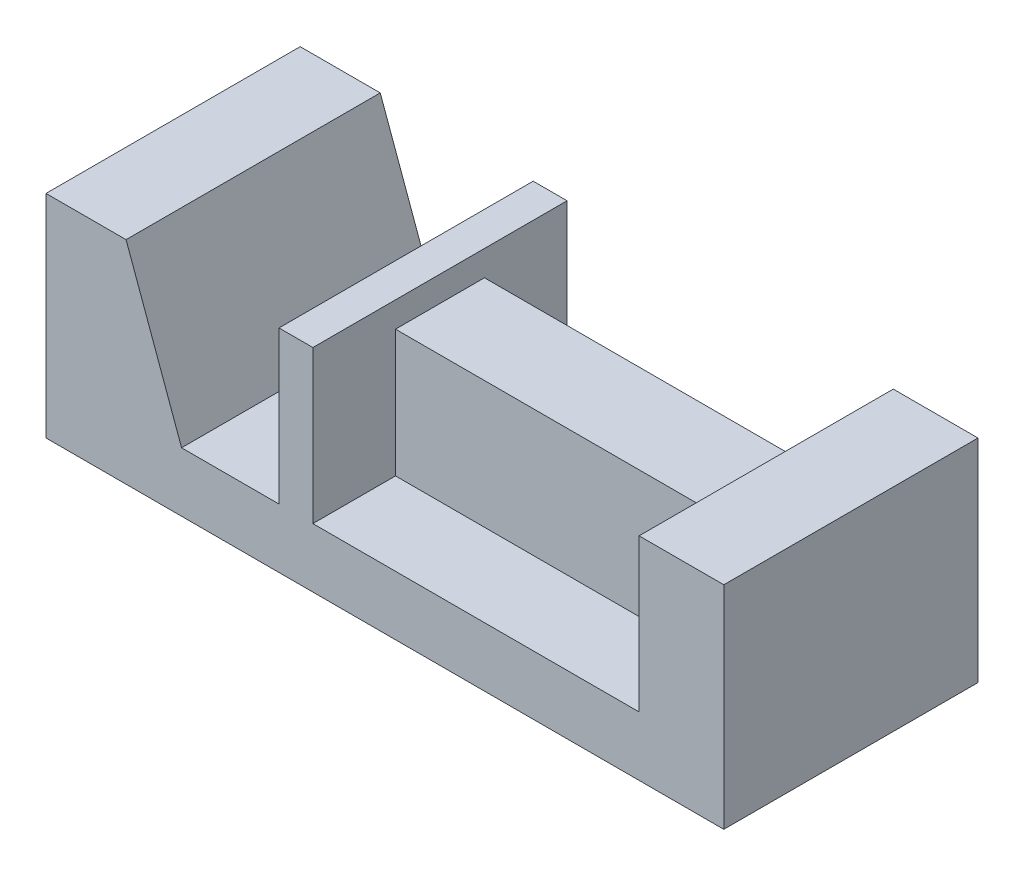
ISO-10303-21;
HEADER;
FILE_DESCRIPTION(('STEP AP214'),'2;1');
FILE_NAME('part.step','',(''),(''),'','','');
FILE_SCHEMA(('AUTOMOTIVE_DESIGN { 1 0 10303 214 1 1 1 1 }'));
ENDSEC;
DATA;
#1=APPLICATION_CONTEXT('core data for automotive mechanical design processes');
#2=APPLICATION_PROTOCOL_DEFINITION('international standard','automotive_design',2000,#1);
#3=PRODUCT_CONTEXT('',#1,'mechanical');
#4=PRODUCT('Part','Part','',(#3));
#5=PRODUCT_RELATED_PRODUCT_CATEGORY('part','',(#4));
#6=PRODUCT_DEFINITION_FORMATION('','',#4);
#7=PRODUCT_DEFINITION_CONTEXT('part definition',#1,'design');
#8=PRODUCT_DEFINITION('design','',#6,#7);
#9=PRODUCT_DEFINITION_SHAPE('','',#8);
#10=(LENGTH_UNIT() NAMED_UNIT(*) SI_UNIT(.MILLI.,.METRE.));
#11=(NAMED_UNIT(*) PLANE_ANGLE_UNIT() SI_UNIT($,.RADIAN.));
#12=(NAMED_UNIT(*) SI_UNIT($,.STERADIAN.) SOLID_ANGLE_UNIT());
#13=UNCERTAINTY_MEASURE_WITH_UNIT(LENGTH_MEASURE(1.E-05),#10,'distance_accuracy_value','');
#14=(GEOMETRIC_REPRESENTATION_CONTEXT(3) GLOBAL_UNCERTAINTY_ASSIGNED_CONTEXT((#13)) GLOBAL_UNIT_ASSIGNED_CONTEXT((#10,
#11,#12)) REPRESENTATION_CONTEXT('',''));
#15=CARTESIAN_POINT('',(0.,0.,0.));
#16=DIRECTION('',(0.,0.,1.));
#17=DIRECTION('',(1.,0.,0.));
#18=AXIS2_PLACEMENT_3D('',#15,#16,#17);
#19=CARTESIAN_POINT('',(81.7250000000001,14.,0.));
#20=DIRECTION('',(1.,0.,0.));
#21=DIRECTION('',(0.,0.,-1.));
#22=AXIS2_PLACEMENT_3D('',#19,#20,#21);
#23=PLANE('',#22);
#24=DIRECTION('',(0.,-1.,0.));
#25=VECTOR('',#24,1.);
#26=CARTESIAN_POINT('',(81.7250000000001,44.,19.5));
#27=LINE('',#26,#25);
#28=CARTESIAN_POINT('',(81.7250000000001,44.,19.5));
#29=VERTEX_POINT('',#28);
#30=CARTESIAN_POINT('',(81.7250000000001,14.,19.5));
#31=VERTEX_POINT('',#30);
#32=EDGE_CURVE('E156',#29,#31,#27,.T.);
#33=ORIENTED_EDGE('',*,*,#32,.F.);
#34=DIRECTION('',(0.,0.,-1.));
#35=VECTOR('',#34,1.);
#36=CARTESIAN_POINT('',(81.7250000000001,44.,19.5));
#37=LINE('',#36,#35);
#38=CARTESIAN_POINT('',(81.7250000000001,44.,40.5));
#39=VERTEX_POINT('',#38);
#40=EDGE_CURVE('E162',#39,#29,#37,.T.);
#41=ORIENTED_EDGE('',*,*,#40,.F.);
#42=DIRECTION('',(0.,-1.,0.));
#43=VECTOR('',#42,1.);
#44=CARTESIAN_POINT('',(81.7250000000001,44.,40.5));
#45=LINE('',#44,#43);
#46=CARTESIAN_POINT('',(81.7250000000001,14.,40.5));
#47=VERTEX_POINT('',#46);
#48=EDGE_CURVE('E474',#39,#47,#45,.T.);
#49=ORIENTED_EDGE('',*,*,#48,.T.);
#50=DIRECTION('',(0.,0.,1.));
#51=VECTOR('',#50,1.);
#52=CARTESIAN_POINT('',(81.7250000000001,14.,0.));
#53=LINE('',#52,#51);
#54=CARTESIAN_POINT('',(81.7250000000001,14.,60.));
#55=VERTEX_POINT('',#54);
#56=EDGE_CURVE('E214',#47,#55,#53,.T.);
#57=ORIENTED_EDGE('',*,*,#56,.T.);
#58=DIRECTION('',(0.,1.,0.));
#59=VECTOR('',#58,1.);
#60=CARTESIAN_POINT('',(81.7250000000001,14.,60.));
#61=LINE('',#60,#59);
#62=CARTESIAN_POINT('',(81.7250000000001,50.,60.));
#63=VERTEX_POINT('',#62);
#64=EDGE_CURVE('E194',#55,#63,#61,.T.);
#65=ORIENTED_EDGE('',*,*,#64,.T.);
#66=DIRECTION('',(0.,0.,1.));
#67=VECTOR('',#66,1.);
#68=CARTESIAN_POINT('',(81.7250000000001,50.,0.));
#69=LINE('',#68,#67);
#70=CARTESIAN_POINT('',(81.7250000000001,50.,0.));
#71=VERTEX_POINT('',#70);
#72=EDGE_CURVE('E207',#71,#63,#69,.T.);
#73=ORIENTED_EDGE('',*,*,#72,.F.);
#74=DIRECTION('',(0.,1.,0.));
#75=VECTOR('',#74,1.);
#76=CARTESIAN_POINT('',(81.7250000000001,14.,0.));
#77=LINE('',#76,#75);
#78=CARTESIAN_POINT('',(81.7250000000001,14.,0.));
#79=VERTEX_POINT('',#78);
#80=EDGE_CURVE('E197',#79,#71,#77,.T.);
#81=ORIENTED_EDGE('',*,*,#80,.F.);
#82=EDGE_CURVE('E176',#79,#31,#53,.T.);
#83=ORIENTED_EDGE('',*,*,#82,.T.);
#84=EDGE_LOOP('',(#33,#41,#49,#57,#65,#73,#81,#83));
#85=FACE_BOUND('',#84,.T.);
#86=ADVANCED_FACE('F40',(#85),#23,.F.);
#87=CARTESIAN_POINT('',(4.72500000000005,14.,0.));
#88=DIRECTION('',(0.,-1.,0.));
#89=DIRECTION('',(1.,0.,0.));
#90=AXIS2_PLACEMENT_3D('',#87,#88,#89);
#91=PLANE('',#90);
#92=DIRECTION('',(-1.,0.,0.));
#93=VECTOR('',#92,1.);
#94=CARTESIAN_POINT('',(4.72500000000005,14.,19.5));
#95=LINE('',#94,#93);
#96=CARTESIAN_POINT('',(4.72500000000005,14.,19.5));
#97=VERTEX_POINT('',#96);
#98=EDGE_CURVE('E479',#31,#97,#95,.T.);
#99=ORIENTED_EDGE('',*,*,#98,.F.);
#100=ORIENTED_EDGE('',*,*,#82,.F.);
#101=DIRECTION('',(1.,0.,0.));
#102=VECTOR('',#101,1.);
#103=CARTESIAN_POINT('',(4.72500000000005,14.,0.));
#104=LINE('',#103,#102);
#105=CARTESIAN_POINT('',(4.72500000000005,14.,0.));
#106=VERTEX_POINT('',#105);
#107=EDGE_CURVE('E64',#106,#79,#104,.T.);
#108=ORIENTED_EDGE('',*,*,#107,.F.);
#109=DIRECTION('',(0.,0.,1.));
#110=VECTOR('',#109,1.);
#111=CARTESIAN_POINT('',(4.72500000000005,14.,0.));
#112=LINE('',#111,#110);
#113=EDGE_CURVE('E215',#106,#97,#112,.T.);
#114=ORIENTED_EDGE('',*,*,#113,.T.);
#115=EDGE_LOOP('',(#99,#100,#108,#114));
#116=FACE_BOUND('',#115,.T.);
#117=ADVANCED_FACE('F367',(#116),#91,.F.);
#118=DIRECTION('',(1.,0.,0.));
#119=VECTOR('',#118,1.);
#120=CARTESIAN_POINT('',(4.72500000000005,14.,40.5));
#121=LINE('',#120,#119);
#122=CARTESIAN_POINT('',(4.72500000000005,14.,40.5));
#123=VERTEX_POINT('',#122);
#124=EDGE_CURVE('E172',#123,#47,#121,.T.);
#125=ORIENTED_EDGE('',*,*,#124,.F.);
#126=CARTESIAN_POINT('',(4.72500000000005,14.,60.));
#127=VERTEX_POINT('',#126);
#128=EDGE_CURVE('E218',#123,#127,#112,.T.);
#129=ORIENTED_EDGE('',*,*,#128,.T.);
#130=DIRECTION('',(1.,0.,0.));
#131=VECTOR('',#130,1.);
#132=CARTESIAN_POINT('',(4.72500000000005,14.,60.));
#133=LINE('',#132,#131);
#134=EDGE_CURVE('E184',#127,#55,#133,.T.);
#135=ORIENTED_EDGE('',*,*,#134,.T.);
#136=ORIENTED_EDGE('',*,*,#56,.F.);
#137=EDGE_LOOP('',(#125,#129,#135,#136));
#138=FACE_BOUND('',#137,.T.);
#139=ADVANCED_FACE('F373',(#138),#91,.F.);
#140=CARTESIAN_POINT('',(4.72500000000004,50.,0.));
#141=DIRECTION('',(-1.,0.,0.));
#142=DIRECTION('',(0.,-1.,0.));
#143=AXIS2_PLACEMENT_3D('',#140,#141,#142);
#144=PLANE('',#143);
#145=DIRECTION('',(0.,-1.,0.));
#146=VECTOR('',#145,1.);
#147=CARTESIAN_POINT('',(4.72500000000005,44.,19.5));
#148=LINE('',#147,#146);
#149=CARTESIAN_POINT('',(4.72500000000004,44.,19.5));
#150=VERTEX_POINT('',#149);
#151=EDGE_CURVE('E56',#150,#97,#148,.T.);
#152=ORIENTED_EDGE('',*,*,#151,.T.);
#153=ORIENTED_EDGE('',*,*,#113,.F.);
#154=DIRECTION('',(0.,-1.,0.));
#155=VECTOR('',#154,1.);
#156=CARTESIAN_POINT('',(4.72500000000004,50.,0.));
#157=LINE('',#156,#155);
#158=CARTESIAN_POINT('',(4.72500000000004,50.,0.));
#159=VERTEX_POINT('',#158);
#160=EDGE_CURVE('E190',#159,#106,#157,.T.);
#161=ORIENTED_EDGE('',*,*,#160,.F.);
#162=DIRECTION('',(0.,0.,1.));
#163=VECTOR('',#162,1.);
#164=CARTESIAN_POINT('',(4.72500000000004,50.,0.));
#165=LINE('',#164,#163);
#166=CARTESIAN_POINT('',(4.72500000000004,50.,60.));
#167=VERTEX_POINT('',#166);
#168=EDGE_CURVE('E200',#159,#167,#165,.T.);
#169=ORIENTED_EDGE('',*,*,#168,.T.);
#170=DIRECTION('',(0.,-1.,0.));
#171=VECTOR('',#170,1.);
#172=CARTESIAN_POINT('',(4.72500000000004,50.,60.));
#173=LINE('',#172,#171);
#174=EDGE_CURVE('E178',#167,#127,#173,.T.);
#175=ORIENTED_EDGE('',*,*,#174,.T.);
#176=ORIENTED_EDGE('',*,*,#128,.F.);
#177=DIRECTION('',(0.,-1.,0.));
#178=VECTOR('',#177,1.);
#179=CARTESIAN_POINT('',(4.72500000000005,44.,40.5));
#180=LINE('',#179,#178);
#181=CARTESIAN_POINT('',(4.72500000000005,44.,40.5));
#182=VERTEX_POINT('',#181);
#183=EDGE_CURVE('E186',#182,#123,#180,.T.);
#184=ORIENTED_EDGE('',*,*,#183,.F.);
#185=DIRECTION('',(0.,0.,1.));
#186=VECTOR('',#185,1.);
#187=CARTESIAN_POINT('',(4.72500000000005,44.,19.5));
#188=LINE('',#187,#186);
#189=EDGE_CURVE('E161',#150,#182,#188,.T.);
#190=ORIENTED_EDGE('',*,*,#189,.F.);
#191=EDGE_LOOP('',(#152,#153,#161,#169,#175,#176,#184,#190));
#192=FACE_BOUND('',#191,.T.);
#193=ADVANCED_FACE('F364',(#192),#144,.F.);
#194=CARTESIAN_POINT('',(-58.275,50.,60.));
#195=DIRECTION('',(0.,-1.,0.));
#196=DIRECTION('',(0.,0.,-1.));
#197=AXIS2_PLACEMENT_3D('',#194,#195,#196);
#198=PLANE('',#197);
#199=DIRECTION('',(-1.,0.,0.));
#200=VECTOR('',#199,1.);
#201=CARTESIAN_POINT('',(-58.275,50.,0.));
#202=LINE('',#201,#200);
#203=CARTESIAN_POINT('',(101.725,50.,0.));
#204=VERTEX_POINT('',#203);
#205=EDGE_CURVE('E263',#204,#71,#202,.T.);
#206=ORIENTED_EDGE('',*,*,#205,.T.);
#207=ORIENTED_EDGE('',*,*,#72,.T.);
#208=DIRECTION('',(-1.,0.,0.));
#209=VECTOR('',#208,1.);
#210=CARTESIAN_POINT('',(-58.275,50.,60.));
#211=LINE('',#210,#209);
#212=CARTESIAN_POINT('',(101.725,50.,60.));
#213=VERTEX_POINT('',#212);
#214=EDGE_CURVE('E270',#213,#63,#211,.T.);
#215=ORIENTED_EDGE('',*,*,#214,.F.);
#216=DIRECTION('',(0.,0.,-1.));
#217=VECTOR('',#216,1.);
#218=CARTESIAN_POINT('',(101.725,50.,60.));
#219=LINE('',#218,#217);
#220=EDGE_CURVE('E293',#213,#204,#219,.T.);
#221=ORIENTED_EDGE('',*,*,#220,.T.);
#222=EDGE_LOOP('',(#206,#207,#215,#221));
#223=FACE_BOUND('',#222,.T.);
#224=ADVANCED_FACE('F311',(#223),#198,.F.);
#225=CARTESIAN_POINT('',(-3.27499999999996,50.,60.));
#226=VERTEX_POINT('',#225);
#227=EDGE_CURVE('E275',#167,#226,#211,.T.);
#228=ORIENTED_EDGE('',*,*,#227,.F.);
#229=ORIENTED_EDGE('',*,*,#168,.F.);
#230=CARTESIAN_POINT('',(-3.27499999999996,50.,0.));
#231=VERTEX_POINT('',#230);
#232=EDGE_CURVE('E289',#159,#231,#202,.T.);
#233=ORIENTED_EDGE('',*,*,#232,.T.);
#234=DIRECTION('',(0.,0.,1.));
#235=VECTOR('',#234,1.);
#236=CARTESIAN_POINT('',(-3.27499999999996,50.,0.));
#237=LINE('',#236,#235);
#238=EDGE_CURVE('E245',#231,#226,#237,.T.);
#239=ORIENTED_EDGE('',*,*,#238,.T.);
#240=EDGE_LOOP('',(#228,#229,#233,#239));
#241=FACE_BOUND('',#240,.T.);
#242=ADVANCED_FACE('F334',(#241),#198,.F.);
#243=CARTESIAN_POINT('',(-58.275,50.,60.));
#244=DIRECTION('',(1.,0.,0.));
#245=DIRECTION('',(0.,0.,-1.));
#246=AXIS2_PLACEMENT_3D('',#243,#244,#245);
#247=PLANE('',#246);
#248=DIRECTION('',(0.,-1.,0.));
#249=VECTOR('',#248,1.);
#250=CARTESIAN_POINT('',(-58.275,50.,0.));
#251=LINE('',#250,#249);
#252=CARTESIAN_POINT('',(-58.275,50.,0.));
#253=VERTEX_POINT('',#252);
#254=CARTESIAN_POINT('',(-58.275,0.,0.));
#255=VERTEX_POINT('',#254);
#256=EDGE_CURVE('E249',#253,#255,#251,.T.);
#257=ORIENTED_EDGE('',*,*,#256,.T.);
#258=DIRECTION('',(0.,0.,-1.));
#259=VECTOR('',#258,1.);
#260=CARTESIAN_POINT('',(-58.275,0.,60.));
#261=LINE('',#260,#259);
#262=CARTESIAN_POINT('',(-58.275,0.,60.));
#263=VERTEX_POINT('',#262);
#264=EDGE_CURVE('E11',#263,#255,#261,.T.);
#265=ORIENTED_EDGE('',*,*,#264,.F.);
#266=DIRECTION('',(0.,-1.,0.));
#267=VECTOR('',#266,1.);
#268=CARTESIAN_POINT('',(-58.275,50.,60.));
#269=LINE('',#268,#267);
#270=CARTESIAN_POINT('',(-58.275,50.,60.));
#271=VERTEX_POINT('',#270);
#272=EDGE_CURVE('E258',#271,#263,#269,.T.);
#273=ORIENTED_EDGE('',*,*,#272,.F.);
#274=DIRECTION('',(0.,0.,-1.));
#275=VECTOR('',#274,1.);
#276=CARTESIAN_POINT('',(-58.275,50.,60.));
#277=LINE('',#276,#275);
#278=EDGE_CURVE('E274',#271,#253,#277,.T.);
#279=ORIENTED_EDGE('',*,*,#278,.T.);
#280=EDGE_LOOP('',(#257,#265,#273,#279));
#281=FACE_BOUND('',#280,.T.);
#282=ADVANCED_FACE('F42',(#281),#247,.F.);
#283=CARTESIAN_POINT('',(-58.275,0.,60.));
#284=DIRECTION('',(0.,1.,0.));
#285=DIRECTION('',(0.,0.,1.));
#286=AXIS2_PLACEMENT_3D('',#283,#284,#285);
#287=PLANE('',#286);
#288=DIRECTION('',(1.,0.,0.));
#289=VECTOR('',#288,1.);
#290=CARTESIAN_POINT('',(-58.275,0.,0.));
#291=LINE('',#290,#289);
#292=CARTESIAN_POINT('',(101.725,0.,0.));
#293=VERTEX_POINT('',#292);
#294=EDGE_CURVE('E279',#255,#293,#291,.T.);
#295=ORIENTED_EDGE('',*,*,#294,.T.);
#296=DIRECTION('',(0.,0.,-1.));
#297=VECTOR('',#296,1.);
#298=CARTESIAN_POINT('',(101.725,0.,60.));
#299=LINE('',#298,#297);
#300=CARTESIAN_POINT('',(101.725,0.,60.));
#301=VERTEX_POINT('',#300);
#302=EDGE_CURVE('E49',#301,#293,#299,.T.);
#303=ORIENTED_EDGE('',*,*,#302,.F.);
#304=DIRECTION('',(1.,0.,0.));
#305=VECTOR('',#304,1.);
#306=CARTESIAN_POINT('',(-58.275,0.,60.));
#307=LINE('',#306,#305);
#308=EDGE_CURVE('E262',#263,#301,#307,.T.);
#309=ORIENTED_EDGE('',*,*,#308,.F.);
#310=ORIENTED_EDGE('',*,*,#264,.T.);
#311=EDGE_LOOP('',(#295,#303,#309,#310));
#312=FACE_BOUND('',#311,.T.);
#313=ADVANCED_FACE('F319',(#312),#287,.F.);
#314=CARTESIAN_POINT('',(101.725,50.,60.));
#315=DIRECTION('',(-1.,0.,0.));
#316=DIRECTION('',(0.,0.,1.));
#317=AXIS2_PLACEMENT_3D('',#314,#315,#316);
#318=PLANE('',#317);
#319=DIRECTION('',(0.,1.,0.));
#320=VECTOR('',#319,1.);
#321=CARTESIAN_POINT('',(101.725,50.,0.));
#322=LINE('',#321,#320);
#323=EDGE_CURVE('E282',#293,#204,#322,.T.);
#324=ORIENTED_EDGE('',*,*,#323,.T.);
#325=ORIENTED_EDGE('',*,*,#220,.F.);
#326=DIRECTION('',(0.,1.,0.));
#327=VECTOR('',#326,1.);
#328=CARTESIAN_POINT('',(101.725,50.,60.));
#329=LINE('',#328,#327);
#330=EDGE_CURVE('E266',#301,#213,#329,.T.);
#331=ORIENTED_EDGE('',*,*,#330,.F.);
#332=ORIENTED_EDGE('',*,*,#302,.T.);
#333=EDGE_LOOP('',(#324,#325,#331,#332));
#334=FACE_BOUND('',#333,.T.);
#335=ADVANCED_FACE('F303',(#334),#318,.F.);
#336=CARTESIAN_POINT('',(-39.3779284335833,50.,60.));
#337=VERTEX_POINT('',#336);
#338=EDGE_CURVE('E269',#337,#271,#211,.T.);
#339=ORIENTED_EDGE('',*,*,#338,.F.);
#340=DIRECTION('',(0.,0.,1.));
#341=VECTOR('',#340,1.);
#342=CARTESIAN_POINT('',(-39.3779284335833,50.,0.));
#343=LINE('',#342,#341);
#344=CARTESIAN_POINT('',(-39.3779284335833,50.,0.));
#345=VERTEX_POINT('',#344);
#346=EDGE_CURVE('E234',#345,#337,#343,.T.);
#347=ORIENTED_EDGE('',*,*,#346,.F.);
#348=EDGE_CURVE('E285',#345,#253,#202,.T.);
#349=ORIENTED_EDGE('',*,*,#348,.T.);
#350=ORIENTED_EDGE('',*,*,#278,.F.);
#351=EDGE_LOOP('',(#339,#347,#349,#350));
#352=FACE_BOUND('',#351,.T.);
#353=ADVANCED_FACE('F352',(#352),#198,.F.);
#354=CARTESIAN_POINT('',(0.,0.,60.));
#355=DIRECTION('',(0.,0.,1.));
#356=DIRECTION('',(1.,0.,0.));
#357=AXIS2_PLACEMENT_3D('',#354,#355,#356);
#358=PLANE('',#357);
#359=ORIENTED_EDGE('',*,*,#64,.F.);
#360=ORIENTED_EDGE('',*,*,#134,.F.);
#361=ORIENTED_EDGE('',*,*,#174,.F.);
#362=ORIENTED_EDGE('',*,*,#227,.T.);
#363=DIRECTION('',(0.,1.,0.));
#364=VECTOR('',#363,1.);
#365=CARTESIAN_POINT('',(-3.27499999999996,14.,60.));
#366=LINE('',#365,#364);
#367=CARTESIAN_POINT('',(-3.27499999999996,14.,60.));
#368=VERTEX_POINT('',#367);
#369=EDGE_CURVE('E226',#368,#226,#366,.T.);
#370=ORIENTED_EDGE('',*,*,#369,.F.);
#371=DIRECTION('',(1.,0.,0.));
#372=VECTOR('',#371,1.);
#373=CARTESIAN_POINT('',(-26.275,14.,60.));
#374=LINE('',#373,#372);
#375=CARTESIAN_POINT('',(-26.275,14.,60.));
#376=VERTEX_POINT('',#375);
#377=EDGE_CURVE('E238',#376,#368,#374,.T.);
#378=ORIENTED_EDGE('',*,*,#377,.F.);
#379=DIRECTION('',(0.34202014332567,-0.939692620785908,0.));
#380=VECTOR('',#379,1.);
#381=CARTESIAN_POINT('',(-39.3779284335833,50.,60.));
#382=LINE('',#381,#380);
#383=EDGE_CURVE('E211',#337,#376,#382,.T.);
#384=ORIENTED_EDGE('',*,*,#383,.F.);
#385=ORIENTED_EDGE('',*,*,#338,.T.);
#386=ORIENTED_EDGE('',*,*,#272,.T.);
#387=ORIENTED_EDGE('',*,*,#308,.T.);
#388=ORIENTED_EDGE('',*,*,#330,.T.);
#389=ORIENTED_EDGE('',*,*,#214,.T.);
#390=EDGE_LOOP('',(#359,#360,#361,#362,#370,#378,#384,#385,#386,#387,#388,#389));
#391=FACE_BOUND('',#390,.T.);
#392=ADVANCED_FACE('F315',(#391),#358,.T.);
#393=CARTESIAN_POINT('',(0.,0.,0.));
#394=DIRECTION('',(0.,0.,1.));
#395=DIRECTION('',(1.,0.,0.));
#396=AXIS2_PLACEMENT_3D('',#393,#394,#395);
#397=PLANE('',#396);
#398=ORIENTED_EDGE('',*,*,#107,.T.);
#399=ORIENTED_EDGE('',*,*,#80,.T.);
#400=ORIENTED_EDGE('',*,*,#205,.F.);
#401=ORIENTED_EDGE('',*,*,#323,.F.);
#402=ORIENTED_EDGE('',*,*,#294,.F.);
#403=ORIENTED_EDGE('',*,*,#256,.F.);
#404=ORIENTED_EDGE('',*,*,#348,.F.);
#405=DIRECTION('',(0.34202014332567,-0.939692620785908,0.));
#406=VECTOR('',#405,1.);
#407=CARTESIAN_POINT('',(-39.3779284335833,50.,0.));
#408=LINE('',#407,#406);
#409=CARTESIAN_POINT('',(-26.275,14.,0.));
#410=VERTEX_POINT('',#409);
#411=EDGE_CURVE('E221',#345,#410,#408,.T.);
#412=ORIENTED_EDGE('',*,*,#411,.T.);
#413=DIRECTION('',(1.,0.,0.));
#414=VECTOR('',#413,1.);
#415=CARTESIAN_POINT('',(-26.275,14.,0.));
#416=LINE('',#415,#414);
#417=CARTESIAN_POINT('',(-3.27499999999996,14.,0.));
#418=VERTEX_POINT('',#417);
#419=EDGE_CURVE('E225',#410,#418,#416,.T.);
#420=ORIENTED_EDGE('',*,*,#419,.T.);
#421=DIRECTION('',(0.,1.,0.));
#422=VECTOR('',#421,1.);
#423=CARTESIAN_POINT('',(-3.27499999999996,14.,0.));
#424=LINE('',#423,#422);
#425=EDGE_CURVE('E230',#418,#231,#424,.T.);
#426=ORIENTED_EDGE('',*,*,#425,.T.);
#427=ORIENTED_EDGE('',*,*,#232,.F.);
#428=ORIENTED_EDGE('',*,*,#160,.T.);
#429=EDGE_LOOP('',(#398,#399,#400,#401,#402,#403,#404,#412,#420,#426,#427,#428));
#430=FACE_BOUND('',#429,.T.);
#431=ADVANCED_FACE('F308',(#430),#397,.F.);
#432=CARTESIAN_POINT('',(-3.27499999999996,14.,0.));
#433=DIRECTION('',(1.,0.,0.));
#434=DIRECTION('',(0.,0.,-1.));
#435=AXIS2_PLACEMENT_3D('',#432,#433,#434);
#436=PLANE('',#435);
#437=ORIENTED_EDGE('',*,*,#369,.T.);
#438=ORIENTED_EDGE('',*,*,#238,.F.);
#439=ORIENTED_EDGE('',*,*,#425,.F.);
#440=DIRECTION('',(0.,0.,1.));
#441=VECTOR('',#440,1.);
#442=CARTESIAN_POINT('',(-3.27499999999996,14.,0.));
#443=LINE('',#442,#441);
#444=EDGE_CURVE('E250',#418,#368,#443,.T.);
#445=ORIENTED_EDGE('',*,*,#444,.T.);
#446=EDGE_LOOP('',(#437,#438,#439,#445));
#447=FACE_BOUND('',#446,.T.);
#448=ADVANCED_FACE('F337',(#447),#436,.F.);
#449=CARTESIAN_POINT('',(-26.275,14.,0.));
#450=DIRECTION('',(0.,-1.,0.));
#451=DIRECTION('',(1.,0.,0.));
#452=AXIS2_PLACEMENT_3D('',#449,#450,#451);
#453=PLANE('',#452);
#454=ORIENTED_EDGE('',*,*,#377,.T.);
#455=ORIENTED_EDGE('',*,*,#444,.F.);
#456=ORIENTED_EDGE('',*,*,#419,.F.);
#457=DIRECTION('',(0.,0.,1.));
#458=VECTOR('',#457,1.);
#459=CARTESIAN_POINT('',(-26.275,14.,0.));
#460=LINE('',#459,#458);
#461=EDGE_CURVE('E253',#410,#376,#460,.T.);
#462=ORIENTED_EDGE('',*,*,#461,.T.);
#463=EDGE_LOOP('',(#454,#455,#456,#462));
#464=FACE_BOUND('',#463,.T.);
#465=ADVANCED_FACE('F341',(#464),#453,.F.);
#466=CARTESIAN_POINT('',(-39.3779284335833,50.,0.));
#467=DIRECTION('',(-0.939692620785908,-0.34202014332567,0.));
#468=DIRECTION('',(0.34202014332567,-0.939692620785908,0.));
#469=AXIS2_PLACEMENT_3D('',#466,#467,#468);
#470=PLANE('',#469);
#471=ORIENTED_EDGE('',*,*,#383,.T.);
#472=ORIENTED_EDGE('',*,*,#461,.F.);
#473=ORIENTED_EDGE('',*,*,#411,.F.);
#474=ORIENTED_EDGE('',*,*,#346,.T.);
#475=EDGE_LOOP('',(#471,#472,#473,#474));
#476=FACE_BOUND('',#475,.T.);
#477=ADVANCED_FACE('F343',(#476),#470,.F.);
#478=CARTESIAN_POINT('',(4.72500000000005,44.,19.5));
#479=DIRECTION('',(0.,0.,1.));
#480=DIRECTION('',(1.,0.,0.));
#481=AXIS2_PLACEMENT_3D('',#478,#479,#480);
#482=PLANE('',#481);
#483=ORIENTED_EDGE('',*,*,#98,.T.);
#484=ORIENTED_EDGE('',*,*,#151,.F.);
#485=DIRECTION('',(-1.,0.,0.));
#486=VECTOR('',#485,1.);
#487=CARTESIAN_POINT('',(4.72500000000005,44.,19.5));
#488=LINE('',#487,#486);
#489=EDGE_CURVE('E152',#29,#150,#488,.T.);
#490=ORIENTED_EDGE('',*,*,#489,.F.);
#491=ORIENTED_EDGE('',*,*,#32,.T.);
#492=EDGE_LOOP('',(#483,#484,#490,#491));
#493=FACE_BOUND('',#492,.T.);
#494=ADVANCED_FACE('F154',(#493),#482,.F.);
#495=CARTESIAN_POINT('',(4.72500000000005,44.,40.5));
#496=DIRECTION('',(0.,0.,-1.));
#497=DIRECTION('',(-1.,0.,0.));
#498=AXIS2_PLACEMENT_3D('',#495,#496,#497);
#499=PLANE('',#498);
#500=ORIENTED_EDGE('',*,*,#124,.T.);
#501=ORIENTED_EDGE('',*,*,#48,.F.);
#502=DIRECTION('',(1.,0.,0.));
#503=VECTOR('',#502,1.);
#504=CARTESIAN_POINT('',(4.72500000000005,44.,40.5));
#505=LINE('',#504,#503);
#506=EDGE_CURVE('E167',#182,#39,#505,.T.);
#507=ORIENTED_EDGE('',*,*,#506,.F.);
#508=ORIENTED_EDGE('',*,*,#183,.T.);
#509=EDGE_LOOP('',(#500,#501,#507,#508));
#510=FACE_BOUND('',#509,.T.);
#511=ADVANCED_FACE('F454',(#510),#499,.F.);
#512=CARTESIAN_POINT('',(0.,44.,0.));
#513=DIRECTION('',(0.,1.,0.));
#514=DIRECTION('',(-1.,0.,0.));
#515=AXIS2_PLACEMENT_3D('',#512,#513,#514);
#516=PLANE('',#515);
#517=ORIENTED_EDGE('',*,*,#40,.T.);
#518=ORIENTED_EDGE('',*,*,#489,.T.);
#519=ORIENTED_EDGE('',*,*,#189,.T.);
#520=ORIENTED_EDGE('',*,*,#506,.T.);
#521=EDGE_LOOP('',(#517,#518,#519,#520));
#522=FACE_BOUND('',#521,.T.);
#523=ADVANCED_FACE('F165',(#522),#516,.T.);
#524=CLOSED_SHELL('',(#86,#117,#139,#193,#224,#242,#282,#313,#335,#353,#392,#431,#448,#465,#477,
#494,#511,#523));
#525=MANIFOLD_SOLID_BREP('B2',#524);
#526=ADVANCED_BREP_SHAPE_REPRESENTATION('',(#18,#525),#14);
#527=SHAPE_DEFINITION_REPRESENTATION(#9,#526);
ENDSEC;
END-ISO-10303-21;
